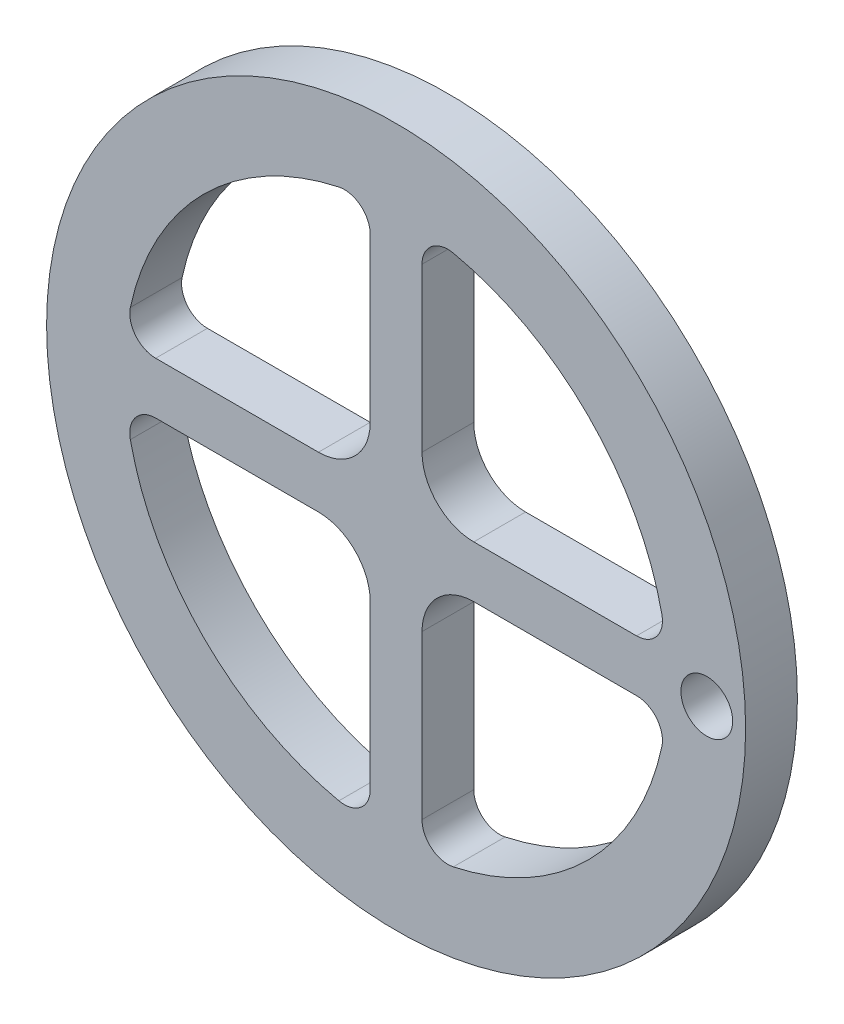
ISO-10303-21;
HEADER;
FILE_DESCRIPTION(('STEP AP214'),'2;1');
FILE_NAME('part.step','',(''),(''),'','','');
FILE_SCHEMA(('AUTOMOTIVE_DESIGN { 1 0 10303 214 1 1 1 1 }'));
ENDSEC;
DATA;
#1=APPLICATION_CONTEXT('core data for automotive mechanical design processes');
#2=APPLICATION_PROTOCOL_DEFINITION('international standard','automotive_design',2000,#1);
#3=PRODUCT_CONTEXT('',#1,'mechanical');
#4=PRODUCT('Part','Part','',(#3));
#5=PRODUCT_RELATED_PRODUCT_CATEGORY('part','',(#4));
#6=PRODUCT_DEFINITION_FORMATION('','',#4);
#7=PRODUCT_DEFINITION_CONTEXT('part definition',#1,'design');
#8=PRODUCT_DEFINITION('design','',#6,#7);
#9=PRODUCT_DEFINITION_SHAPE('','',#8);
#10=(LENGTH_UNIT() NAMED_UNIT(*) SI_UNIT(.MILLI.,.METRE.));
#11=(NAMED_UNIT(*) PLANE_ANGLE_UNIT() SI_UNIT($,.RADIAN.));
#12=(NAMED_UNIT(*) SI_UNIT($,.STERADIAN.) SOLID_ANGLE_UNIT());
#13=UNCERTAINTY_MEASURE_WITH_UNIT(LENGTH_MEASURE(1.E-05),#10,'distance_accuracy_value','');
#14=(GEOMETRIC_REPRESENTATION_CONTEXT(3) GLOBAL_UNCERTAINTY_ASSIGNED_CONTEXT((#13)) GLOBAL_UNIT_ASSIGNED_CONTEXT((#10,
#11,#12)) REPRESENTATION_CONTEXT('',''));
#15=CARTESIAN_POINT('',(0.,0.,0.));
#16=DIRECTION('',(0.,0.,1.));
#17=DIRECTION('',(1.,0.,0.));
#18=AXIS2_PLACEMENT_3D('',#15,#16,#17);
#19=CARTESIAN_POINT('',(0.,0.,4.));
#20=DIRECTION('',(0.,0.,1.));
#21=DIRECTION('',(1.,0.,0.));
#22=AXIS2_PLACEMENT_3D('',#19,#20,#21);
#23=PLANE('',#22);
#24=DIRECTION('',(1.,0.,0.));
#25=VECTOR('',#24,1.);
#26=CARTESIAN_POINT('',(18.5741756210067,2.,4.));
#27=LINE('',#26,#25);
#28=CARTESIAN_POINT('',(6.,2.,4.));
#29=VERTEX_POINT('',#28);
#30=CARTESIAN_POINT('',(18.5741756210067,2.,4.));
#31=VERTEX_POINT('',#30);
#32=EDGE_CURVE('E246',#29,#31,#27,.T.);
#33=ORIENTED_EDGE('',*,*,#32,.F.);
#34=CARTESIAN_POINT('',(6.,6.,4.));
#35=DIRECTION('',(0.,0.,1.));
#36=DIRECTION('',(-1.,0.,0.));
#37=AXIS2_PLACEMENT_3D('',#34,#35,#36);
#38=CIRCLE('',#37,4.);
#39=CARTESIAN_POINT('',(2.,6.,4.));
#40=VERTEX_POINT('',#39);
#41=EDGE_CURVE('E244',#40,#29,#38,.T.);
#42=ORIENTED_EDGE('',*,*,#41,.F.);
#43=DIRECTION('',(0.,-1.,0.));
#44=VECTOR('',#43,1.);
#45=CARTESIAN_POINT('',(2.,18.5741756210067,4.));
#46=LINE('',#45,#44);
#47=CARTESIAN_POINT('',(2.,18.5741756210067,4.));
#48=VERTEX_POINT('',#47);
#49=EDGE_CURVE('E256',#48,#40,#46,.T.);
#50=ORIENTED_EDGE('',*,*,#49,.F.);
#51=CARTESIAN_POINT('',(4.,18.5741756210067,4.));
#52=DIRECTION('',(0.,0.,1.));
#53=DIRECTION('',(1.,0.,0.));
#54=AXIS2_PLACEMENT_3D('',#51,#52,#53);
#55=CIRCLE('',#54,2.);
#56=CARTESIAN_POINT('',(4.42105263157895,20.5293520021653,4.));
#57=VERTEX_POINT('',#56);
#58=EDGE_CURVE('E253',#57,#48,#55,.T.);
#59=ORIENTED_EDGE('',*,*,#58,.F.);
#60=CARTESIAN_POINT('',(0.,0.,4.));
#61=DIRECTION('',(0.,0.,1.));
#62=DIRECTION('',(1.,0.,0.));
#63=AXIS2_PLACEMENT_3D('',#60,#61,#62);
#64=CIRCLE('',#63,21.);
#65=CARTESIAN_POINT('',(20.5293520021653,4.42105263157895,4.));
#66=VERTEX_POINT('',#65);
#67=EDGE_CURVE('E251',#66,#57,#64,.T.);
#68=ORIENTED_EDGE('',*,*,#67,.F.);
#69=CARTESIAN_POINT('',(18.5741756210067,4.,4.));
#70=DIRECTION('',(0.,0.,1.));
#71=DIRECTION('',(-1.,0.,0.));
#72=AXIS2_PLACEMENT_3D('',#69,#70,#71);
#73=CIRCLE('',#72,2.);
#74=EDGE_CURVE('E249',#31,#66,#73,.T.);
#75=ORIENTED_EDGE('',*,*,#74,.F.);
#76=EDGE_LOOP('',(#33,#42,#50,#59,#68,#75));
#77=FACE_BOUND('',#76,.T.);
#78=CARTESIAN_POINT('',(24.,0.,4.));
#79=DIRECTION('',(0.,0.,1.));
#80=DIRECTION('',(1.,0.,0.));
#81=AXIS2_PLACEMENT_3D('',#78,#79,#80);
#82=CIRCLE('',#81,2.);
#83=CARTESIAN_POINT('',(26.,0.,4.));
#84=VERTEX_POINT('',#83);
#85=EDGE_CURVE('E334',#84,#84,#82,.T.);
#86=ORIENTED_EDGE('',*,*,#85,.F.);
#87=EDGE_LOOP('',(#86));
#88=FACE_BOUND('',#87,.T.);
#89=CARTESIAN_POINT('',(0.,0.,4.));
#90=DIRECTION('',(0.,0.,1.));
#91=DIRECTION('',(1.,0.,0.));
#92=AXIS2_PLACEMENT_3D('',#89,#90,#91);
#93=CIRCLE('',#92,27.);
#94=CARTESIAN_POINT('',(27.,0.,4.));
#95=VERTEX_POINT('',#94);
#96=EDGE_CURVE('E11',#95,#95,#93,.T.);
#97=ORIENTED_EDGE('',*,*,#96,.T.);
#98=EDGE_LOOP('',(#97));
#99=FACE_BOUND('',#98,.T.);
#100=DIRECTION('',(-1.,0.,0.));
#101=VECTOR('',#100,1.);
#102=CARTESIAN_POINT('',(-6.,-2.,4.));
#103=LINE('',#102,#101);
#104=CARTESIAN_POINT('',(-6.,-2.,4.));
#105=VERTEX_POINT('',#104);
#106=CARTESIAN_POINT('',(-18.5741756210067,-2.,4.));
#107=VERTEX_POINT('',#106);
#108=EDGE_CURVE('E342',#105,#107,#103,.T.);
#109=ORIENTED_EDGE('',*,*,#108,.F.);
#110=CARTESIAN_POINT('',(-6.,-6.,4.));
#111=DIRECTION('',(0.,0.,1.));
#112=DIRECTION('',(-1.,0.,0.));
#113=AXIS2_PLACEMENT_3D('',#110,#111,#112);
#114=CIRCLE('',#113,4.);
#115=CARTESIAN_POINT('',(-2.,-6.,4.));
#116=VERTEX_POINT('',#115);
#117=EDGE_CURVE('E340',#116,#105,#114,.T.);
#118=ORIENTED_EDGE('',*,*,#117,.F.);
#119=DIRECTION('',(0.,1.,0.));
#120=VECTOR('',#119,1.);
#121=CARTESIAN_POINT('',(-2.,-6.,4.));
#122=LINE('',#121,#120);
#123=CARTESIAN_POINT('',(-2.,-18.5741756210067,4.));
#124=VERTEX_POINT('',#123);
#125=EDGE_CURVE('E352',#124,#116,#122,.T.);
#126=ORIENTED_EDGE('',*,*,#125,.F.);
#127=CARTESIAN_POINT('',(-4.,-18.5741756210067,4.));
#128=DIRECTION('',(0.,0.,1.));
#129=DIRECTION('',(-1.,0.,0.));
#130=AXIS2_PLACEMENT_3D('',#127,#128,#129);
#131=CIRCLE('',#130,2.);
#132=CARTESIAN_POINT('',(-4.42105263157895,-20.5293520021653,4.));
#133=VERTEX_POINT('',#132);
#134=EDGE_CURVE('E349',#133,#124,#131,.T.);
#135=ORIENTED_EDGE('',*,*,#134,.F.);
#136=CARTESIAN_POINT('',(0.,0.,4.));
#137=DIRECTION('',(0.,0.,1.));
#138=DIRECTION('',(1.,0.,0.));
#139=AXIS2_PLACEMENT_3D('',#136,#137,#138);
#140=CIRCLE('',#139,21.);
#141=CARTESIAN_POINT('',(-20.5293520021653,-4.42105263157895,4.));
#142=VERTEX_POINT('',#141);
#143=EDGE_CURVE('E347',#142,#133,#140,.T.);
#144=ORIENTED_EDGE('',*,*,#143,.F.);
#145=CARTESIAN_POINT('',(-18.5741756210067,-4.,4.));
#146=DIRECTION('',(0.,0.,1.));
#147=DIRECTION('',(1.,0.,0.));
#148=AXIS2_PLACEMENT_3D('',#145,#146,#147);
#149=CIRCLE('',#148,2.);
#150=EDGE_CURVE('E345',#107,#142,#149,.T.);
#151=ORIENTED_EDGE('',*,*,#150,.F.);
#152=EDGE_LOOP('',(#109,#118,#126,#135,#144,#151));
#153=FACE_BOUND('',#152,.T.);
#154=DIRECTION('',(0.,-1.,0.));
#155=VECTOR('',#154,1.);
#156=CARTESIAN_POINT('',(2.,-6.,4.));
#157=LINE('',#156,#155);
#158=CARTESIAN_POINT('',(2.,-6.,4.));
#159=VERTEX_POINT('',#158);
#160=CARTESIAN_POINT('',(2.,-18.5741756210067,4.));
#161=VERTEX_POINT('',#160);
#162=EDGE_CURVE('E291',#159,#161,#157,.T.);
#163=ORIENTED_EDGE('',*,*,#162,.F.);
#164=CARTESIAN_POINT('',(6.,-6.,4.));
#165=DIRECTION('',(0.,0.,1.));
#166=DIRECTION('',(-1.,0.,0.));
#167=AXIS2_PLACEMENT_3D('',#164,#165,#166);
#168=CIRCLE('',#167,4.);
#169=CARTESIAN_POINT('',(6.,-2.,4.));
#170=VERTEX_POINT('',#169);
#171=EDGE_CURVE('E289',#170,#159,#168,.T.);
#172=ORIENTED_EDGE('',*,*,#171,.F.);
#173=DIRECTION('',(-1.,0.,0.));
#174=VECTOR('',#173,1.);
#175=CARTESIAN_POINT('',(18.5741756210067,-2.,4.));
#176=LINE('',#175,#174);
#177=CARTESIAN_POINT('',(18.5741756210067,-2.,4.));
#178=VERTEX_POINT('',#177);
#179=EDGE_CURVE('E301',#178,#170,#176,.T.);
#180=ORIENTED_EDGE('',*,*,#179,.F.);
#181=CARTESIAN_POINT('',(18.5741756210067,-4.,4.));
#182=DIRECTION('',(0.,0.,1.));
#183=DIRECTION('',(1.,0.,0.));
#184=AXIS2_PLACEMENT_3D('',#181,#182,#183);
#185=CIRCLE('',#184,2.);
#186=CARTESIAN_POINT('',(20.5293520021653,-4.42105263157895,4.));
#187=VERTEX_POINT('',#186);
#188=EDGE_CURVE('E298',#187,#178,#185,.T.);
#189=ORIENTED_EDGE('',*,*,#188,.F.);
#190=CARTESIAN_POINT('',(0.,0.,4.));
#191=DIRECTION('',(0.,0.,1.));
#192=DIRECTION('',(1.,0.,0.));
#193=AXIS2_PLACEMENT_3D('',#190,#191,#192);
#194=CIRCLE('',#193,21.);
#195=CARTESIAN_POINT('',(4.42105263157895,-20.5293520021653,4.));
#196=VERTEX_POINT('',#195);
#197=EDGE_CURVE('E296',#196,#187,#194,.T.);
#198=ORIENTED_EDGE('',*,*,#197,.F.);
#199=CARTESIAN_POINT('',(4.,-18.5741756210067,4.));
#200=DIRECTION('',(0.,0.,1.));
#201=DIRECTION('',(-1.,0.,0.));
#202=AXIS2_PLACEMENT_3D('',#199,#200,#201);
#203=CIRCLE('',#202,2.);
#204=EDGE_CURVE('E294',#161,#196,#203,.T.);
#205=ORIENTED_EDGE('',*,*,#204,.F.);
#206=EDGE_LOOP('',(#163,#172,#180,#189,#198,#205));
#207=FACE_BOUND('',#206,.T.);
#208=DIRECTION('',(0.,1.,0.));
#209=VECTOR('',#208,1.);
#210=CARTESIAN_POINT('',(-2.,18.5741756210067,4.));
#211=LINE('',#210,#209);
#212=CARTESIAN_POINT('',(-2.,6.,4.));
#213=VERTEX_POINT('',#212);
#214=CARTESIAN_POINT('',(-2.,18.5741756210067,4.));
#215=VERTEX_POINT('',#214);
#216=EDGE_CURVE('E201',#213,#215,#211,.T.);
#217=ORIENTED_EDGE('',*,*,#216,.F.);
#218=CARTESIAN_POINT('',(-6.,6.,4.));
#219=DIRECTION('',(0.,0.,1.));
#220=DIRECTION('',(-1.,0.,0.));
#221=AXIS2_PLACEMENT_3D('',#218,#219,#220);
#222=CIRCLE('',#221,4.);
#223=CARTESIAN_POINT('',(-6.,2.,4.));
#224=VERTEX_POINT('',#223);
#225=EDGE_CURVE('E193',#224,#213,#222,.T.);
#226=ORIENTED_EDGE('',*,*,#225,.F.);
#227=DIRECTION('',(1.,0.,0.));
#228=VECTOR('',#227,1.);
#229=CARTESIAN_POINT('',(-6.,2.,4.));
#230=LINE('',#229,#228);
#231=CARTESIAN_POINT('',(-18.5741756210067,2.,4.));
#232=VERTEX_POINT('',#231);
#233=EDGE_CURVE('E222',#232,#224,#230,.T.);
#234=ORIENTED_EDGE('',*,*,#233,.F.);
#235=CARTESIAN_POINT('',(-18.5741756210067,4.,4.));
#236=DIRECTION('',(0.,0.,1.));
#237=DIRECTION('',(-1.,0.,0.));
#238=AXIS2_PLACEMENT_3D('',#235,#236,#237);
#239=CIRCLE('',#238,2.);
#240=CARTESIAN_POINT('',(-20.5293520021653,4.42105263157894,4.));
#241=VERTEX_POINT('',#240);
#242=EDGE_CURVE('E220',#241,#232,#239,.T.);
#243=ORIENTED_EDGE('',*,*,#242,.F.);
#244=CARTESIAN_POINT('',(0.,0.,4.));
#245=DIRECTION('',(0.,0.,1.));
#246=DIRECTION('',(1.,0.,0.));
#247=AXIS2_PLACEMENT_3D('',#244,#245,#246);
#248=CIRCLE('',#247,21.);
#249=CARTESIAN_POINT('',(-4.42105263157895,20.5293520021653,4.));
#250=VERTEX_POINT('',#249);
#251=EDGE_CURVE('E216',#250,#241,#248,.T.);
#252=ORIENTED_EDGE('',*,*,#251,.F.);
#253=CARTESIAN_POINT('',(-4.,18.5741756210067,4.));
#254=DIRECTION('',(0.,0.,1.));
#255=DIRECTION('',(1.,0.,0.));
#256=AXIS2_PLACEMENT_3D('',#253,#254,#255);
#257=CIRCLE('',#256,2.);
#258=EDGE_CURVE('E214',#215,#250,#257,.T.);
#259=ORIENTED_EDGE('',*,*,#258,.F.);
#260=EDGE_LOOP('',(#217,#226,#234,#243,#252,#259));
#261=FACE_BOUND('',#260,.T.);
#262=ADVANCED_FACE('F32',(#77,#88,#99,#153,#207,#261),#23,.T.);
#263=CARTESIAN_POINT('',(0.,0.,0.));
#264=DIRECTION('',(0.,0.,1.));
#265=DIRECTION('',(1.,0.,0.));
#266=AXIS2_PLACEMENT_3D('',#263,#264,#265);
#267=PLANE('',#266);
#268=CARTESIAN_POINT('',(6.,6.,0.));
#269=DIRECTION('',(0.,0.,1.));
#270=DIRECTION('',(-1.,0.,0.));
#271=AXIS2_PLACEMENT_3D('',#268,#269,#270);
#272=CIRCLE('',#271,4.);
#273=CARTESIAN_POINT('',(2.,6.,0.));
#274=VERTEX_POINT('',#273);
#275=CARTESIAN_POINT('',(6.,2.,0.));
#276=VERTEX_POINT('',#275);
#277=EDGE_CURVE('E209',#274,#276,#272,.T.);
#278=ORIENTED_EDGE('',*,*,#277,.T.);
#279=DIRECTION('',(1.,0.,0.));
#280=VECTOR('',#279,1.);
#281=CARTESIAN_POINT('',(18.5741756210067,2.,0.));
#282=LINE('',#281,#280);
#283=CARTESIAN_POINT('',(18.5741756210067,2.,0.));
#284=VERTEX_POINT('',#283);
#285=EDGE_CURVE('E261',#276,#284,#282,.T.);
#286=ORIENTED_EDGE('',*,*,#285,.T.);
#287=CARTESIAN_POINT('',(18.5741756210067,4.,0.));
#288=DIRECTION('',(0.,0.,1.));
#289=DIRECTION('',(-1.,0.,0.));
#290=AXIS2_PLACEMENT_3D('',#287,#288,#289);
#291=CIRCLE('',#290,2.);
#292=CARTESIAN_POINT('',(20.5293520021653,4.42105263157895,0.));
#293=VERTEX_POINT('',#292);
#294=EDGE_CURVE('E264',#284,#293,#291,.T.);
#295=ORIENTED_EDGE('',*,*,#294,.T.);
#296=CARTESIAN_POINT('',(0.,0.,0.));
#297=DIRECTION('',(0.,0.,1.));
#298=DIRECTION('',(1.,0.,0.));
#299=AXIS2_PLACEMENT_3D('',#296,#297,#298);
#300=CIRCLE('',#299,21.);
#301=CARTESIAN_POINT('',(4.42105263157895,20.5293520021653,0.));
#302=VERTEX_POINT('',#301);
#303=EDGE_CURVE('E267',#293,#302,#300,.T.);
#304=ORIENTED_EDGE('',*,*,#303,.T.);
#305=CARTESIAN_POINT('',(4.,18.5741756210067,0.));
#306=DIRECTION('',(0.,0.,1.));
#307=DIRECTION('',(1.,0.,0.));
#308=AXIS2_PLACEMENT_3D('',#305,#306,#307);
#309=CIRCLE('',#308,2.);
#310=CARTESIAN_POINT('',(2.,18.5741756210067,0.));
#311=VERTEX_POINT('',#310);
#312=EDGE_CURVE('E270',#302,#311,#309,.T.);
#313=ORIENTED_EDGE('',*,*,#312,.T.);
#314=DIRECTION('',(0.,-1.,0.));
#315=VECTOR('',#314,1.);
#316=CARTESIAN_POINT('',(2.,18.5741756210067,0.));
#317=LINE('',#316,#315);
#318=EDGE_CURVE('E247',#311,#274,#317,.T.);
#319=ORIENTED_EDGE('',*,*,#318,.T.);
#320=EDGE_LOOP('',(#278,#286,#295,#304,#313,#319));
#321=FACE_BOUND('',#320,.T.);
#322=CARTESIAN_POINT('',(24.,0.,0.));
#323=DIRECTION('',(0.,0.,1.));
#324=DIRECTION('',(1.,0.,0.));
#325=AXIS2_PLACEMENT_3D('',#322,#323,#324);
#326=CIRCLE('',#325,2.);
#327=CARTESIAN_POINT('',(26.,0.,0.));
#328=VERTEX_POINT('',#327);
#329=EDGE_CURVE('E333',#328,#328,#326,.T.);
#330=ORIENTED_EDGE('',*,*,#329,.T.);
#331=EDGE_LOOP('',(#330));
#332=FACE_BOUND('',#331,.T.);
#333=CARTESIAN_POINT('',(0.,0.,0.));
#334=DIRECTION('',(0.,0.,1.));
#335=DIRECTION('',(1.,0.,0.));
#336=AXIS2_PLACEMENT_3D('',#333,#334,#335);
#337=CIRCLE('',#336,27.);
#338=CARTESIAN_POINT('',(27.,0.,0.));
#339=VERTEX_POINT('',#338);
#340=EDGE_CURVE('E36',#339,#339,#337,.T.);
#341=ORIENTED_EDGE('',*,*,#340,.F.);
#342=EDGE_LOOP('',(#341));
#343=FACE_BOUND('',#342,.T.);
#344=CARTESIAN_POINT('',(-6.,-6.,0.));
#345=DIRECTION('',(0.,0.,1.));
#346=DIRECTION('',(-1.,0.,0.));
#347=AXIS2_PLACEMENT_3D('',#344,#345,#346);
#348=CIRCLE('',#347,4.);
#349=CARTESIAN_POINT('',(-2.,-6.,0.));
#350=VERTEX_POINT('',#349);
#351=CARTESIAN_POINT('',(-6.,-2.,0.));
#352=VERTEX_POINT('',#351);
#353=EDGE_CURVE('E337',#350,#352,#348,.T.);
#354=ORIENTED_EDGE('',*,*,#353,.T.);
#355=DIRECTION('',(-1.,0.,0.));
#356=VECTOR('',#355,1.);
#357=CARTESIAN_POINT('',(-6.,-2.,0.));
#358=LINE('',#357,#356);
#359=CARTESIAN_POINT('',(-18.5741756210067,-2.,0.));
#360=VERTEX_POINT('',#359);
#361=EDGE_CURVE('E357',#352,#360,#358,.T.);
#362=ORIENTED_EDGE('',*,*,#361,.T.);
#363=CARTESIAN_POINT('',(-18.5741756210067,-4.,0.));
#364=DIRECTION('',(0.,0.,1.));
#365=DIRECTION('',(1.,0.,0.));
#366=AXIS2_PLACEMENT_3D('',#363,#364,#365);
#367=CIRCLE('',#366,2.);
#368=CARTESIAN_POINT('',(-20.5293520021653,-4.42105263157895,0.));
#369=VERTEX_POINT('',#368);
#370=EDGE_CURVE('E360',#360,#369,#367,.T.);
#371=ORIENTED_EDGE('',*,*,#370,.T.);
#372=CARTESIAN_POINT('',(0.,0.,0.));
#373=DIRECTION('',(0.,0.,1.));
#374=DIRECTION('',(1.,0.,0.));
#375=AXIS2_PLACEMENT_3D('',#372,#373,#374);
#376=CIRCLE('',#375,21.);
#377=CARTESIAN_POINT('',(-4.42105263157895,-20.5293520021653,0.));
#378=VERTEX_POINT('',#377);
#379=EDGE_CURVE('E363',#369,#378,#376,.T.);
#380=ORIENTED_EDGE('',*,*,#379,.T.);
#381=CARTESIAN_POINT('',(-4.,-18.5741756210067,0.));
#382=DIRECTION('',(0.,0.,1.));
#383=DIRECTION('',(-1.,0.,0.));
#384=AXIS2_PLACEMENT_3D('',#381,#382,#383);
#385=CIRCLE('',#384,2.);
#386=CARTESIAN_POINT('',(-2.,-18.5741756210067,0.));
#387=VERTEX_POINT('',#386);
#388=EDGE_CURVE('E366',#378,#387,#385,.T.);
#389=ORIENTED_EDGE('',*,*,#388,.T.);
#390=DIRECTION('',(0.,1.,0.));
#391=VECTOR('',#390,1.);
#392=CARTESIAN_POINT('',(-2.,-6.,0.));
#393=LINE('',#392,#391);
#394=EDGE_CURVE('E343',#387,#350,#393,.T.);
#395=ORIENTED_EDGE('',*,*,#394,.T.);
#396=EDGE_LOOP('',(#354,#362,#371,#380,#389,#395));
#397=FACE_BOUND('',#396,.T.);
#398=CARTESIAN_POINT('',(6.,-6.,0.));
#399=DIRECTION('',(0.,0.,1.));
#400=DIRECTION('',(-1.,0.,0.));
#401=AXIS2_PLACEMENT_3D('',#398,#399,#400);
#402=CIRCLE('',#401,4.);
#403=CARTESIAN_POINT('',(6.,-2.,0.));
#404=VERTEX_POINT('',#403);
#405=CARTESIAN_POINT('',(2.,-6.,0.));
#406=VERTEX_POINT('',#405);
#407=EDGE_CURVE('E288',#404,#406,#402,.T.);
#408=ORIENTED_EDGE('',*,*,#407,.T.);
#409=DIRECTION('',(0.,-1.,0.));
#410=VECTOR('',#409,1.);
#411=CARTESIAN_POINT('',(2.,-6.,0.));
#412=LINE('',#411,#410);
#413=CARTESIAN_POINT('',(2.,-18.5741756210067,0.));
#414=VERTEX_POINT('',#413);
#415=EDGE_CURVE('E306',#406,#414,#412,.T.);
#416=ORIENTED_EDGE('',*,*,#415,.T.);
#417=CARTESIAN_POINT('',(4.,-18.5741756210067,0.));
#418=DIRECTION('',(0.,0.,1.));
#419=DIRECTION('',(-1.,0.,0.));
#420=AXIS2_PLACEMENT_3D('',#417,#418,#419);
#421=CIRCLE('',#420,2.);
#422=CARTESIAN_POINT('',(4.42105263157895,-20.5293520021653,0.));
#423=VERTEX_POINT('',#422);
#424=EDGE_CURVE('E309',#414,#423,#421,.T.);
#425=ORIENTED_EDGE('',*,*,#424,.T.);
#426=CARTESIAN_POINT('',(0.,0.,0.));
#427=DIRECTION('',(0.,0.,1.));
#428=DIRECTION('',(1.,0.,0.));
#429=AXIS2_PLACEMENT_3D('',#426,#427,#428);
#430=CIRCLE('',#429,21.);
#431=CARTESIAN_POINT('',(20.5293520021653,-4.42105263157895,0.));
#432=VERTEX_POINT('',#431);
#433=EDGE_CURVE('E312',#423,#432,#430,.T.);
#434=ORIENTED_EDGE('',*,*,#433,.T.);
#435=CARTESIAN_POINT('',(18.5741756210067,-4.,0.));
#436=DIRECTION('',(0.,0.,1.));
#437=DIRECTION('',(1.,0.,0.));
#438=AXIS2_PLACEMENT_3D('',#435,#436,#437);
#439=CIRCLE('',#438,2.);
#440=CARTESIAN_POINT('',(18.5741756210067,-2.,0.));
#441=VERTEX_POINT('',#440);
#442=EDGE_CURVE('E315',#432,#441,#439,.T.);
#443=ORIENTED_EDGE('',*,*,#442,.T.);
#444=DIRECTION('',(-1.,0.,0.));
#445=VECTOR('',#444,1.);
#446=CARTESIAN_POINT('',(18.5741756210067,-2.,0.));
#447=LINE('',#446,#445);
#448=EDGE_CURVE('E292',#441,#404,#447,.T.);
#449=ORIENTED_EDGE('',*,*,#448,.T.);
#450=EDGE_LOOP('',(#408,#416,#425,#434,#443,#449));
#451=FACE_BOUND('',#450,.T.);
#452=CARTESIAN_POINT('',(-6.,6.,0.));
#453=DIRECTION('',(0.,0.,1.));
#454=DIRECTION('',(-1.,0.,0.));
#455=AXIS2_PLACEMENT_3D('',#452,#453,#454);
#456=CIRCLE('',#455,4.);
#457=CARTESIAN_POINT('',(-6.,2.,0.));
#458=VERTEX_POINT('',#457);
#459=CARTESIAN_POINT('',(-2.,6.,0.));
#460=VERTEX_POINT('',#459);
#461=EDGE_CURVE('E55',#458,#460,#456,.T.);
#462=ORIENTED_EDGE('',*,*,#461,.T.);
#463=DIRECTION('',(0.,1.,0.));
#464=VECTOR('',#463,1.);
#465=CARTESIAN_POINT('',(-2.,18.5741756210067,0.));
#466=LINE('',#465,#464);
#467=CARTESIAN_POINT('',(-2.,18.5741756210067,0.));
#468=VERTEX_POINT('',#467);
#469=EDGE_CURVE('E208',#460,#468,#466,.T.);
#470=ORIENTED_EDGE('',*,*,#469,.T.);
#471=CARTESIAN_POINT('',(-4.,18.5741756210067,0.));
#472=DIRECTION('',(0.,0.,1.));
#473=DIRECTION('',(1.,0.,0.));
#474=AXIS2_PLACEMENT_3D('',#471,#472,#473);
#475=CIRCLE('',#474,2.);
#476=CARTESIAN_POINT('',(-4.42105263157895,20.5293520021653,0.));
#477=VERTEX_POINT('',#476);
#478=EDGE_CURVE('E226',#468,#477,#475,.T.);
#479=ORIENTED_EDGE('',*,*,#478,.T.);
#480=CARTESIAN_POINT('',(0.,0.,0.));
#481=DIRECTION('',(0.,0.,1.));
#482=DIRECTION('',(1.,0.,0.));
#483=AXIS2_PLACEMENT_3D('',#480,#481,#482);
#484=CIRCLE('',#483,21.);
#485=CARTESIAN_POINT('',(-20.5293520021653,4.42105263157894,0.));
#486=VERTEX_POINT('',#485);
#487=EDGE_CURVE('E229',#477,#486,#484,.T.);
#488=ORIENTED_EDGE('',*,*,#487,.T.);
#489=CARTESIAN_POINT('',(-18.5741756210067,4.,0.));
#490=DIRECTION('',(0.,0.,1.));
#491=DIRECTION('',(-1.,0.,0.));
#492=AXIS2_PLACEMENT_3D('',#489,#490,#491);
#493=CIRCLE('',#492,2.);
#494=CARTESIAN_POINT('',(-18.5741756210067,2.,0.));
#495=VERTEX_POINT('',#494);
#496=EDGE_CURVE('E232',#486,#495,#493,.T.);
#497=ORIENTED_EDGE('',*,*,#496,.T.);
#498=DIRECTION('',(1.,0.,0.));
#499=VECTOR('',#498,1.);
#500=CARTESIAN_POINT('',(-6.,2.,0.));
#501=LINE('',#500,#499);
#502=EDGE_CURVE('E202',#495,#458,#501,.T.);
#503=ORIENTED_EDGE('',*,*,#502,.T.);
#504=EDGE_LOOP('',(#462,#470,#479,#488,#497,#503));
#505=FACE_BOUND('',#504,.T.);
#506=ADVANCED_FACE('F389',(#321,#332,#343,#397,#451,#505),#267,.F.);
#507=CARTESIAN_POINT('',(0.,0.,4.));
#508=DIRECTION('',(0.,0.,-1.));
#509=DIRECTION('',(-1.,0.,0.));
#510=AXIS2_PLACEMENT_3D('',#507,#508,#509);
#511=CYLINDRICAL_SURFACE('',#510,27.);
#512=ORIENTED_EDGE('',*,*,#96,.F.);
#513=EDGE_LOOP('',(#512));
#514=FACE_BOUND('',#513,.T.);
#515=ORIENTED_EDGE('',*,*,#340,.T.);
#516=EDGE_LOOP('',(#515));
#517=FACE_BOUND('',#516,.T.);
#518=ADVANCED_FACE('F34',(#514,#517),#511,.T.);
#519=CARTESIAN_POINT('',(-6.,-6.,4.));
#520=DIRECTION('',(0.,0.,-1.));
#521=DIRECTION('',(-1.,0.,0.));
#522=AXIS2_PLACEMENT_3D('',#519,#520,#521);
#523=CYLINDRICAL_SURFACE('',#522,4.);
#524=ORIENTED_EDGE('',*,*,#353,.F.);
#525=DIRECTION('',(0.,0.,-1.));
#526=VECTOR('',#525,1.);
#527=CARTESIAN_POINT('',(-2.,-6.,4.));
#528=LINE('',#527,#526);
#529=EDGE_CURVE('E354',#116,#350,#528,.T.);
#530=ORIENTED_EDGE('',*,*,#529,.F.);
#531=ORIENTED_EDGE('',*,*,#117,.T.);
#532=DIRECTION('',(0.,0.,-1.));
#533=VECTOR('',#532,1.);
#534=CARTESIAN_POINT('',(-6.,-2.,4.));
#535=LINE('',#534,#533);
#536=EDGE_CURVE('E381',#105,#352,#535,.T.);
#537=ORIENTED_EDGE('',*,*,#536,.T.);
#538=EDGE_LOOP('',(#524,#530,#531,#537));
#539=FACE_BOUND('',#538,.T.);
#540=ADVANCED_FACE('F424',(#539),#523,.F.);
#541=CARTESIAN_POINT('',(-6.,-2.,4.));
#542=DIRECTION('',(0.,-1.,0.));
#543=DIRECTION('',(1.,0.,0.));
#544=AXIS2_PLACEMENT_3D('',#541,#542,#543);
#545=PLANE('',#544);
#546=ORIENTED_EDGE('',*,*,#361,.F.);
#547=ORIENTED_EDGE('',*,*,#536,.F.);
#548=ORIENTED_EDGE('',*,*,#108,.T.);
#549=DIRECTION('',(0.,0.,-1.));
#550=VECTOR('',#549,1.);
#551=CARTESIAN_POINT('',(-18.5741756210067,-2.,4.));
#552=LINE('',#551,#550);
#553=EDGE_CURVE('E379',#107,#360,#552,.T.);
#554=ORIENTED_EDGE('',*,*,#553,.T.);
#555=EDGE_LOOP('',(#546,#547,#548,#554));
#556=FACE_BOUND('',#555,.T.);
#557=ADVANCED_FACE('F427',(#556),#545,.T.);
#558=CARTESIAN_POINT('',(-18.5741756210067,-4.,4.));
#559=DIRECTION('',(0.,0.,-1.));
#560=DIRECTION('',(-1.,0.,0.));
#561=AXIS2_PLACEMENT_3D('',#558,#559,#560);
#562=CYLINDRICAL_SURFACE('',#561,2.);
#563=ORIENTED_EDGE('',*,*,#370,.F.);
#564=ORIENTED_EDGE('',*,*,#553,.F.);
#565=ORIENTED_EDGE('',*,*,#150,.T.);
#566=DIRECTION('',(0.,0.,-1.));
#567=VECTOR('',#566,1.);
#568=CARTESIAN_POINT('',(-20.5293520021653,-4.42105263157895,4.));
#569=LINE('',#568,#567);
#570=EDGE_CURVE('E377',#142,#369,#569,.T.);
#571=ORIENTED_EDGE('',*,*,#570,.T.);
#572=EDGE_LOOP('',(#563,#564,#565,#571));
#573=FACE_BOUND('',#572,.T.);
#574=ADVANCED_FACE('F430',(#573),#562,.F.);
#575=CARTESIAN_POINT('',(0.,0.,4.));
#576=DIRECTION('',(0.,0.,-1.));
#577=DIRECTION('',(-1.,0.,0.));
#578=AXIS2_PLACEMENT_3D('',#575,#576,#577);
#579=CYLINDRICAL_SURFACE('',#578,21.);
#580=ORIENTED_EDGE('',*,*,#379,.F.);
#581=ORIENTED_EDGE('',*,*,#570,.F.);
#582=ORIENTED_EDGE('',*,*,#143,.T.);
#583=DIRECTION('',(0.,0.,-1.));
#584=VECTOR('',#583,1.);
#585=CARTESIAN_POINT('',(-4.42105263157895,-20.5293520021653,4.));
#586=LINE('',#585,#584);
#587=EDGE_CURVE('E375',#133,#378,#586,.T.);
#588=ORIENTED_EDGE('',*,*,#587,.T.);
#589=EDGE_LOOP('',(#580,#581,#582,#588));
#590=FACE_BOUND('',#589,.T.);
#591=ADVANCED_FACE('F434',(#590),#579,.F.);
#592=CARTESIAN_POINT('',(-4.,-18.5741756210067,4.));
#593=DIRECTION('',(0.,0.,-1.));
#594=DIRECTION('',(-1.,0.,0.));
#595=AXIS2_PLACEMENT_3D('',#592,#593,#594);
#596=CYLINDRICAL_SURFACE('',#595,2.);
#597=ORIENTED_EDGE('',*,*,#388,.F.);
#598=ORIENTED_EDGE('',*,*,#587,.F.);
#599=ORIENTED_EDGE('',*,*,#134,.T.);
#600=DIRECTION('',(0.,0.,-1.));
#601=VECTOR('',#600,1.);
#602=CARTESIAN_POINT('',(-2.,-18.5741756210067,4.));
#603=LINE('',#602,#601);
#604=EDGE_CURVE('E373',#124,#387,#603,.T.);
#605=ORIENTED_EDGE('',*,*,#604,.T.);
#606=EDGE_LOOP('',(#597,#598,#599,#605));
#607=FACE_BOUND('',#606,.T.);
#608=ADVANCED_FACE('F438',(#607),#596,.F.);
#609=CARTESIAN_POINT('',(-2.,-6.,4.));
#610=DIRECTION('',(-1.,0.,0.));
#611=DIRECTION('',(0.,-1.,0.));
#612=AXIS2_PLACEMENT_3D('',#609,#610,#611);
#613=PLANE('',#612);
#614=ORIENTED_EDGE('',*,*,#394,.F.);
#615=ORIENTED_EDGE('',*,*,#604,.F.);
#616=ORIENTED_EDGE('',*,*,#125,.T.);
#617=ORIENTED_EDGE('',*,*,#529,.T.);
#618=EDGE_LOOP('',(#614,#615,#616,#617));
#619=FACE_BOUND('',#618,.T.);
#620=ADVANCED_FACE('F442',(#619),#613,.T.);
#621=CARTESIAN_POINT('',(24.,0.,4.));
#622=DIRECTION('',(0.,0.,-1.));
#623=DIRECTION('',(-1.,0.,0.));
#624=AXIS2_PLACEMENT_3D('',#621,#622,#623);
#625=CYLINDRICAL_SURFACE('',#624,2.);
#626=ORIENTED_EDGE('',*,*,#85,.T.);
#627=EDGE_LOOP('',(#626));
#628=FACE_BOUND('',#627,.T.);
#629=ORIENTED_EDGE('',*,*,#329,.F.);
#630=EDGE_LOOP('',(#629));
#631=FACE_BOUND('',#630,.T.);
#632=ADVANCED_FACE('F446',(#628,#631),#625,.F.);
#633=CARTESIAN_POINT('',(6.,-6.,4.));
#634=DIRECTION('',(0.,0.,-1.));
#635=DIRECTION('',(-1.,0.,0.));
#636=AXIS2_PLACEMENT_3D('',#633,#634,#635);
#637=CYLINDRICAL_SURFACE('',#636,4.);
#638=ORIENTED_EDGE('',*,*,#407,.F.);
#639=DIRECTION('',(0.,0.,-1.));
#640=VECTOR('',#639,1.);
#641=CARTESIAN_POINT('',(6.,-2.,4.));
#642=LINE('',#641,#640);
#643=EDGE_CURVE('E303',#170,#404,#642,.T.);
#644=ORIENTED_EDGE('',*,*,#643,.F.);
#645=ORIENTED_EDGE('',*,*,#171,.T.);
#646=DIRECTION('',(0.,0.,-1.));
#647=VECTOR('',#646,1.);
#648=CARTESIAN_POINT('',(2.,-6.,4.));
#649=LINE('',#648,#647);
#650=EDGE_CURVE('E330',#159,#406,#649,.T.);
#651=ORIENTED_EDGE('',*,*,#650,.T.);
#652=EDGE_LOOP('',(#638,#644,#645,#651));
#653=FACE_BOUND('',#652,.T.);
#654=ADVANCED_FACE('F450',(#653),#637,.F.);
#655=CARTESIAN_POINT('',(2.,-6.,4.));
#656=DIRECTION('',(1.,0.,0.));
#657=DIRECTION('',(0.,1.,0.));
#658=AXIS2_PLACEMENT_3D('',#655,#656,#657);
#659=PLANE('',#658);
#660=ORIENTED_EDGE('',*,*,#415,.F.);
#661=ORIENTED_EDGE('',*,*,#650,.F.);
#662=ORIENTED_EDGE('',*,*,#162,.T.);
#663=DIRECTION('',(0.,0.,-1.));
#664=VECTOR('',#663,1.);
#665=CARTESIAN_POINT('',(2.,-18.5741756210067,4.));
#666=LINE('',#665,#664);
#667=EDGE_CURVE('E328',#161,#414,#666,.T.);
#668=ORIENTED_EDGE('',*,*,#667,.T.);
#669=EDGE_LOOP('',(#660,#661,#662,#668));
#670=FACE_BOUND('',#669,.T.);
#671=ADVANCED_FACE('F454',(#670),#659,.T.);
#672=CARTESIAN_POINT('',(4.,-18.5741756210067,4.));
#673=DIRECTION('',(0.,0.,-1.));
#674=DIRECTION('',(-1.,0.,0.));
#675=AXIS2_PLACEMENT_3D('',#672,#673,#674);
#676=CYLINDRICAL_SURFACE('',#675,2.);
#677=ORIENTED_EDGE('',*,*,#424,.F.);
#678=ORIENTED_EDGE('',*,*,#667,.F.);
#679=ORIENTED_EDGE('',*,*,#204,.T.);
#680=DIRECTION('',(0.,0.,-1.));
#681=VECTOR('',#680,1.);
#682=CARTESIAN_POINT('',(4.42105263157895,-20.5293520021653,4.));
#683=LINE('',#682,#681);
#684=EDGE_CURVE('E326',#196,#423,#683,.T.);
#685=ORIENTED_EDGE('',*,*,#684,.T.);
#686=EDGE_LOOP('',(#677,#678,#679,#685));
#687=FACE_BOUND('',#686,.T.);
#688=ADVANCED_FACE('F458',(#687),#676,.F.);
#689=CARTESIAN_POINT('',(0.,0.,4.));
#690=DIRECTION('',(0.,0.,-1.));
#691=DIRECTION('',(-1.,0.,0.));
#692=AXIS2_PLACEMENT_3D('',#689,#690,#691);
#693=CYLINDRICAL_SURFACE('',#692,21.);
#694=ORIENTED_EDGE('',*,*,#433,.F.);
#695=ORIENTED_EDGE('',*,*,#684,.F.);
#696=ORIENTED_EDGE('',*,*,#197,.T.);
#697=DIRECTION('',(0.,0.,-1.));
#698=VECTOR('',#697,1.);
#699=CARTESIAN_POINT('',(20.5293520021653,-4.42105263157895,4.));
#700=LINE('',#699,#698);
#701=EDGE_CURVE('E324',#187,#432,#700,.T.);
#702=ORIENTED_EDGE('',*,*,#701,.T.);
#703=EDGE_LOOP('',(#694,#695,#696,#702));
#704=FACE_BOUND('',#703,.T.);
#705=ADVANCED_FACE('F462',(#704),#693,.F.);
#706=CARTESIAN_POINT('',(18.5741756210067,-4.,4.));
#707=DIRECTION('',(0.,0.,-1.));
#708=DIRECTION('',(-1.,0.,0.));
#709=AXIS2_PLACEMENT_3D('',#706,#707,#708);
#710=CYLINDRICAL_SURFACE('',#709,2.);
#711=ORIENTED_EDGE('',*,*,#442,.F.);
#712=ORIENTED_EDGE('',*,*,#701,.F.);
#713=ORIENTED_EDGE('',*,*,#188,.T.);
#714=DIRECTION('',(0.,0.,-1.));
#715=VECTOR('',#714,1.);
#716=CARTESIAN_POINT('',(18.5741756210067,-2.,4.));
#717=LINE('',#716,#715);
#718=EDGE_CURVE('E322',#178,#441,#717,.T.);
#719=ORIENTED_EDGE('',*,*,#718,.T.);
#720=EDGE_LOOP('',(#711,#712,#713,#719));
#721=FACE_BOUND('',#720,.T.);
#722=ADVANCED_FACE('F466',(#721),#710,.F.);
#723=CARTESIAN_POINT('',(18.5741756210067,-2.,4.));
#724=DIRECTION('',(0.,-1.,0.));
#725=DIRECTION('',(1.,0.,0.));
#726=AXIS2_PLACEMENT_3D('',#723,#724,#725);
#727=PLANE('',#726);
#728=ORIENTED_EDGE('',*,*,#448,.F.);
#729=ORIENTED_EDGE('',*,*,#718,.F.);
#730=ORIENTED_EDGE('',*,*,#179,.T.);
#731=ORIENTED_EDGE('',*,*,#643,.T.);
#732=EDGE_LOOP('',(#728,#729,#730,#731));
#733=FACE_BOUND('',#732,.T.);
#734=ADVANCED_FACE('F470',(#733),#727,.T.);
#735=CARTESIAN_POINT('',(6.,6.,4.));
#736=DIRECTION('',(0.,0.,-1.));
#737=DIRECTION('',(-1.,0.,0.));
#738=AXIS2_PLACEMENT_3D('',#735,#736,#737);
#739=CYLINDRICAL_SURFACE('',#738,4.);
#740=ORIENTED_EDGE('',*,*,#277,.F.);
#741=DIRECTION('',(0.,0.,-1.));
#742=VECTOR('',#741,1.);
#743=CARTESIAN_POINT('',(2.,6.,4.));
#744=LINE('',#743,#742);
#745=EDGE_CURVE('E258',#40,#274,#744,.T.);
#746=ORIENTED_EDGE('',*,*,#745,.F.);
#747=ORIENTED_EDGE('',*,*,#41,.T.);
#748=DIRECTION('',(0.,0.,-1.));
#749=VECTOR('',#748,1.);
#750=CARTESIAN_POINT('',(6.,2.,4.));
#751=LINE('',#750,#749);
#752=EDGE_CURVE('E285',#29,#276,#751,.T.);
#753=ORIENTED_EDGE('',*,*,#752,.T.);
#754=EDGE_LOOP('',(#740,#746,#747,#753));
#755=FACE_BOUND('',#754,.T.);
#756=ADVANCED_FACE('F474',(#755),#739,.F.);
#757=CARTESIAN_POINT('',(18.5741756210067,2.,4.));
#758=DIRECTION('',(0.,1.,0.));
#759=DIRECTION('',(-1.,0.,0.));
#760=AXIS2_PLACEMENT_3D('',#757,#758,#759);
#761=PLANE('',#760);
#762=ORIENTED_EDGE('',*,*,#285,.F.);
#763=ORIENTED_EDGE('',*,*,#752,.F.);
#764=ORIENTED_EDGE('',*,*,#32,.T.);
#765=DIRECTION('',(0.,0.,-1.));
#766=VECTOR('',#765,1.);
#767=CARTESIAN_POINT('',(18.5741756210067,2.,4.));
#768=LINE('',#767,#766);
#769=EDGE_CURVE('E283',#31,#284,#768,.T.);
#770=ORIENTED_EDGE('',*,*,#769,.T.);
#771=EDGE_LOOP('',(#762,#763,#764,#770));
#772=FACE_BOUND('',#771,.T.);
#773=ADVANCED_FACE('F478',(#772),#761,.T.);
#774=CARTESIAN_POINT('',(18.5741756210067,4.,4.));
#775=DIRECTION('',(0.,0.,-1.));
#776=DIRECTION('',(-1.,0.,0.));
#777=AXIS2_PLACEMENT_3D('',#774,#775,#776);
#778=CYLINDRICAL_SURFACE('',#777,2.);
#779=ORIENTED_EDGE('',*,*,#294,.F.);
#780=ORIENTED_EDGE('',*,*,#769,.F.);
#781=ORIENTED_EDGE('',*,*,#74,.T.);
#782=DIRECTION('',(0.,0.,-1.));
#783=VECTOR('',#782,1.);
#784=CARTESIAN_POINT('',(20.5293520021653,4.42105263157895,4.));
#785=LINE('',#784,#783);
#786=EDGE_CURVE('E281',#66,#293,#785,.T.);
#787=ORIENTED_EDGE('',*,*,#786,.T.);
#788=EDGE_LOOP('',(#779,#780,#781,#787));
#789=FACE_BOUND('',#788,.T.);
#790=ADVANCED_FACE('F482',(#789),#778,.F.);
#791=CARTESIAN_POINT('',(0.,0.,4.));
#792=DIRECTION('',(0.,0.,-1.));
#793=DIRECTION('',(-1.,0.,0.));
#794=AXIS2_PLACEMENT_3D('',#791,#792,#793);
#795=CYLINDRICAL_SURFACE('',#794,21.);
#796=ORIENTED_EDGE('',*,*,#303,.F.);
#797=ORIENTED_EDGE('',*,*,#786,.F.);
#798=ORIENTED_EDGE('',*,*,#67,.T.);
#799=DIRECTION('',(0.,0.,-1.));
#800=VECTOR('',#799,1.);
#801=CARTESIAN_POINT('',(4.42105263157895,20.5293520021653,4.));
#802=LINE('',#801,#800);
#803=EDGE_CURVE('E279',#57,#302,#802,.T.);
#804=ORIENTED_EDGE('',*,*,#803,.T.);
#805=EDGE_LOOP('',(#796,#797,#798,#804));
#806=FACE_BOUND('',#805,.T.);
#807=ADVANCED_FACE('F486',(#806),#795,.F.);
#808=CARTESIAN_POINT('',(4.,18.5741756210067,4.));
#809=DIRECTION('',(0.,0.,-1.));
#810=DIRECTION('',(-1.,0.,0.));
#811=AXIS2_PLACEMENT_3D('',#808,#809,#810);
#812=CYLINDRICAL_SURFACE('',#811,2.);
#813=ORIENTED_EDGE('',*,*,#312,.F.);
#814=ORIENTED_EDGE('',*,*,#803,.F.);
#815=ORIENTED_EDGE('',*,*,#58,.T.);
#816=DIRECTION('',(0.,0.,-1.));
#817=VECTOR('',#816,1.);
#818=CARTESIAN_POINT('',(2.,18.5741756210067,4.));
#819=LINE('',#818,#817);
#820=EDGE_CURVE('E277',#48,#311,#819,.T.);
#821=ORIENTED_EDGE('',*,*,#820,.T.);
#822=EDGE_LOOP('',(#813,#814,#815,#821));
#823=FACE_BOUND('',#822,.T.);
#824=ADVANCED_FACE('F490',(#823),#812,.F.);
#825=CARTESIAN_POINT('',(2.,18.5741756210067,4.));
#826=DIRECTION('',(1.,0.,0.));
#827=DIRECTION('',(0.,0.,-1.));
#828=AXIS2_PLACEMENT_3D('',#825,#826,#827);
#829=PLANE('',#828);
#830=ORIENTED_EDGE('',*,*,#318,.F.);
#831=ORIENTED_EDGE('',*,*,#820,.F.);
#832=ORIENTED_EDGE('',*,*,#49,.T.);
#833=ORIENTED_EDGE('',*,*,#745,.T.);
#834=EDGE_LOOP('',(#830,#831,#832,#833));
#835=FACE_BOUND('',#834,.T.);
#836=ADVANCED_FACE('F494',(#835),#829,.T.);
#837=CARTESIAN_POINT('',(-6.,6.,4.));
#838=DIRECTION('',(0.,0.,-1.));
#839=DIRECTION('',(-1.,0.,0.));
#840=AXIS2_PLACEMENT_3D('',#837,#838,#839);
#841=CYLINDRICAL_SURFACE('',#840,4.);
#842=ORIENTED_EDGE('',*,*,#461,.F.);
#843=DIRECTION('',(0.,0.,-1.));
#844=VECTOR('',#843,1.);
#845=CARTESIAN_POINT('',(-6.,2.,4.));
#846=LINE('',#845,#844);
#847=EDGE_CURVE('E197',#224,#458,#846,.T.);
#848=ORIENTED_EDGE('',*,*,#847,.F.);
#849=ORIENTED_EDGE('',*,*,#225,.T.);
#850=DIRECTION('',(0.,0.,-1.));
#851=VECTOR('',#850,1.);
#852=CARTESIAN_POINT('',(-2.,6.,4.));
#853=LINE('',#852,#851);
#854=EDGE_CURVE('E196',#213,#460,#853,.T.);
#855=ORIENTED_EDGE('',*,*,#854,.T.);
#856=EDGE_LOOP('',(#842,#848,#849,#855));
#857=FACE_BOUND('',#856,.T.);
#858=ADVANCED_FACE('F195',(#857),#841,.F.);
#859=CARTESIAN_POINT('',(-2.,18.5741756210067,4.));
#860=DIRECTION('',(-1.,0.,0.));
#861=DIRECTION('',(0.,0.,1.));
#862=AXIS2_PLACEMENT_3D('',#859,#860,#861);
#863=PLANE('',#862);
#864=ORIENTED_EDGE('',*,*,#469,.F.);
#865=ORIENTED_EDGE('',*,*,#854,.F.);
#866=ORIENTED_EDGE('',*,*,#216,.T.);
#867=DIRECTION('',(0.,0.,-1.));
#868=VECTOR('',#867,1.);
#869=CARTESIAN_POINT('',(-2.,18.5741756210067,4.));
#870=LINE('',#869,#868);
#871=EDGE_CURVE('E210',#215,#468,#870,.T.);
#872=ORIENTED_EDGE('',*,*,#871,.T.);
#873=EDGE_LOOP('',(#864,#865,#866,#872));
#874=FACE_BOUND('',#873,.T.);
#875=ADVANCED_FACE('F205',(#874),#863,.T.);
#876=CARTESIAN_POINT('',(-4.,18.5741756210067,4.));
#877=DIRECTION('',(0.,0.,-1.));
#878=DIRECTION('',(-1.,0.,0.));
#879=AXIS2_PLACEMENT_3D('',#876,#877,#878);
#880=CYLINDRICAL_SURFACE('',#879,2.);
#881=ORIENTED_EDGE('',*,*,#478,.F.);
#882=ORIENTED_EDGE('',*,*,#871,.F.);
#883=ORIENTED_EDGE('',*,*,#258,.T.);
#884=DIRECTION('',(0.,0.,-1.));
#885=VECTOR('',#884,1.);
#886=CARTESIAN_POINT('',(-4.42105263157895,20.5293520021653,4.));
#887=LINE('',#886,#885);
#888=EDGE_CURVE('E241',#250,#477,#887,.T.);
#889=ORIENTED_EDGE('',*,*,#888,.T.);
#890=EDGE_LOOP('',(#881,#882,#883,#889));
#891=FACE_BOUND('',#890,.T.);
#892=ADVANCED_FACE('F407',(#891),#880,.F.);
#893=CARTESIAN_POINT('',(0.,0.,4.));
#894=DIRECTION('',(0.,0.,-1.));
#895=DIRECTION('',(-1.,0.,0.));
#896=AXIS2_PLACEMENT_3D('',#893,#894,#895);
#897=CYLINDRICAL_SURFACE('',#896,21.);
#898=ORIENTED_EDGE('',*,*,#487,.F.);
#899=ORIENTED_EDGE('',*,*,#888,.F.);
#900=ORIENTED_EDGE('',*,*,#251,.T.);
#901=DIRECTION('',(0.,0.,-1.));
#902=VECTOR('',#901,1.);
#903=CARTESIAN_POINT('',(-20.5293520021653,4.42105263157894,4.));
#904=LINE('',#903,#902);
#905=EDGE_CURVE('E239',#241,#486,#904,.T.);
#906=ORIENTED_EDGE('',*,*,#905,.T.);
#907=EDGE_LOOP('',(#898,#899,#900,#906));
#908=FACE_BOUND('',#907,.T.);
#909=ADVANCED_FACE('F403',(#908),#897,.F.);
#910=CARTESIAN_POINT('',(-18.5741756210067,4.,4.));
#911=DIRECTION('',(0.,0.,-1.));
#912=DIRECTION('',(-1.,0.,0.));
#913=AXIS2_PLACEMENT_3D('',#910,#911,#912);
#914=CYLINDRICAL_SURFACE('',#913,2.);
#915=ORIENTED_EDGE('',*,*,#496,.F.);
#916=ORIENTED_EDGE('',*,*,#905,.F.);
#917=ORIENTED_EDGE('',*,*,#242,.T.);
#918=DIRECTION('',(0.,0.,-1.));
#919=VECTOR('',#918,1.);
#920=CARTESIAN_POINT('',(-18.5741756210067,2.,4.));
#921=LINE('',#920,#919);
#922=EDGE_CURVE('E47',#232,#495,#921,.T.);
#923=ORIENTED_EDGE('',*,*,#922,.T.);
#924=EDGE_LOOP('',(#915,#916,#917,#923));
#925=FACE_BOUND('',#924,.T.);
#926=ADVANCED_FACE('F400',(#925),#914,.F.);
#927=CARTESIAN_POINT('',(-6.,2.,4.));
#928=DIRECTION('',(0.,1.,0.));
#929=DIRECTION('',(0.,0.,1.));
#930=AXIS2_PLACEMENT_3D('',#927,#928,#929);
#931=PLANE('',#930);
#932=ORIENTED_EDGE('',*,*,#502,.F.);
#933=ORIENTED_EDGE('',*,*,#922,.F.);
#934=ORIENTED_EDGE('',*,*,#233,.T.);
#935=ORIENTED_EDGE('',*,*,#847,.T.);
#936=EDGE_LOOP('',(#932,#933,#934,#935));
#937=FACE_BOUND('',#936,.T.);
#938=ADVANCED_FACE('F396',(#937),#931,.T.);
#939=CLOSED_SHELL('',(#262,#506,#518,#540,#557,#574,#591,#608,#620,#632,#654,#671,#688,#705,
#722,#734,#756,#773,#790,#807,#824,#836,#858,#875,#892,#909,#926,#938));
#940=MANIFOLD_SOLID_BREP('B2',#939);
#941=ADVANCED_BREP_SHAPE_REPRESENTATION('',(#18,#940),#14);
#942=SHAPE_DEFINITION_REPRESENTATION(#9,#941);
ENDSEC;
END-ISO-10303-21;
